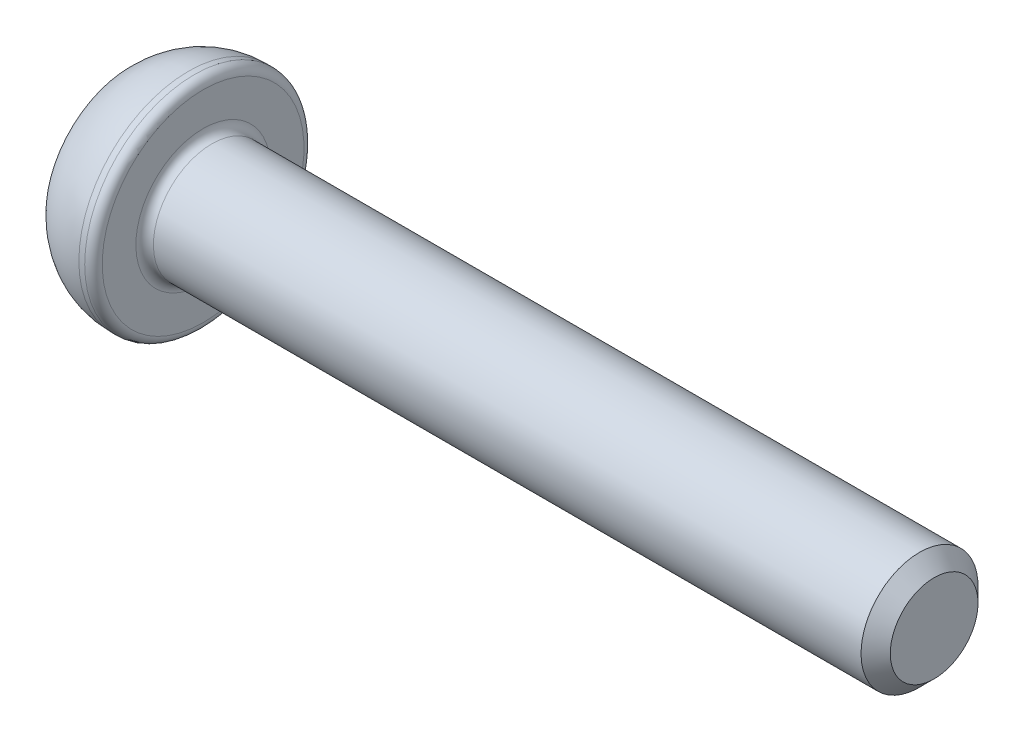
ISO-10303-21;
HEADER;
FILE_DESCRIPTION(('STEP AP214'),'2;1');
FILE_NAME('part.step','',(''),(''),'','','');
FILE_SCHEMA(('AUTOMOTIVE_DESIGN { 1 0 10303 214 1 1 1 1 }'));
ENDSEC;
DATA;
#1=APPLICATION_CONTEXT('core data for automotive mechanical design processes');
#2=APPLICATION_PROTOCOL_DEFINITION('international standard','automotive_design',2000,#1);
#3=PRODUCT_CONTEXT('',#1,'mechanical');
#4=PRODUCT('Part','Part','',(#3));
#5=PRODUCT_RELATED_PRODUCT_CATEGORY('part','',(#4));
#6=PRODUCT_DEFINITION_FORMATION('','',#4);
#7=PRODUCT_DEFINITION_CONTEXT('part definition',#1,'design');
#8=PRODUCT_DEFINITION('design','',#6,#7);
#9=PRODUCT_DEFINITION_SHAPE('','',#8);
#10=(LENGTH_UNIT() NAMED_UNIT(*) SI_UNIT(.MILLI.,.METRE.));
#11=(NAMED_UNIT(*) PLANE_ANGLE_UNIT() SI_UNIT($,.RADIAN.));
#12=(NAMED_UNIT(*) SI_UNIT($,.STERADIAN.) SOLID_ANGLE_UNIT());
#13=UNCERTAINTY_MEASURE_WITH_UNIT(LENGTH_MEASURE(1.E-05),#10,'distance_accuracy_value','');
#14=(GEOMETRIC_REPRESENTATION_CONTEXT(3) GLOBAL_UNCERTAINTY_ASSIGNED_CONTEXT((#13)) GLOBAL_UNIT_ASSIGNED_CONTEXT((#10,
#11,#12)) REPRESENTATION_CONTEXT('',''));
#15=CARTESIAN_POINT('',(0.,0.,0.));
#16=DIRECTION('',(0.,0.,1.));
#17=DIRECTION('',(1.,0.,0.));
#18=AXIS2_PLACEMENT_3D('',#15,#16,#17);
#19=CARTESIAN_POINT('',(0.,0.,0.));
#20=DIRECTION('',(-1.,0.,0.));
#21=DIRECTION('',(0.,-1.,0.));
#22=AXIS2_PLACEMENT_3D('',#19,#20,#21);
#23=PLANE('',#22);
#24=DIRECTION('',(0.,0.866025403784438,-0.5));
#25=VECTOR('',#24,1.);
#26=CARTESIAN_POINT('',(0.,0.,1.44337567297407));
#27=LINE('',#26,#25);
#28=CARTESIAN_POINT('',(0.,0.,1.44337567297407));
#29=VERTEX_POINT('',#28);
#30=CARTESIAN_POINT('',(0.,1.25,0.721687836487032));
#31=VERTEX_POINT('',#30);
#32=EDGE_CURVE('E55',#29,#31,#27,.T.);
#33=ORIENTED_EDGE('',*,*,#32,.F.);
#34=DIRECTION('',(0.,0.866025403784438,0.5));
#35=VECTOR('',#34,1.);
#36=CARTESIAN_POINT('',(0.,-1.25,0.721687836487033));
#37=LINE('',#36,#35);
#38=CARTESIAN_POINT('',(0.,-1.25,0.721687836487033));
#39=VERTEX_POINT('',#38);
#40=EDGE_CURVE('E138',#39,#29,#37,.T.);
#41=ORIENTED_EDGE('',*,*,#40,.F.);
#42=DIRECTION('',(0.,0.,1.));
#43=VECTOR('',#42,1.);
#44=CARTESIAN_POINT('',(0.,-1.25,-0.721687836487032));
#45=LINE('',#44,#43);
#46=CARTESIAN_POINT('',(0.,-1.25,-0.721687836487032));
#47=VERTEX_POINT('',#46);
#48=EDGE_CURVE('E136',#47,#39,#45,.T.);
#49=ORIENTED_EDGE('',*,*,#48,.F.);
#50=DIRECTION('',(0.,-0.866025403784438,0.5));
#51=VECTOR('',#50,1.);
#52=CARTESIAN_POINT('',(0.,0.,-1.44337567297407));
#53=LINE('',#52,#51);
#54=CARTESIAN_POINT('',(0.,0.,-1.44337567297407));
#55=VERTEX_POINT('',#54);
#56=EDGE_CURVE('E103',#55,#47,#53,.T.);
#57=ORIENTED_EDGE('',*,*,#56,.F.);
#58=DIRECTION('',(0.,-0.866025403784438,-0.5));
#59=VECTOR('',#58,1.);
#60=CARTESIAN_POINT('',(0.,1.25,-0.721687836487032));
#61=LINE('',#60,#59);
#62=CARTESIAN_POINT('',(0.,1.25,-0.721687836487032));
#63=VERTEX_POINT('',#62);
#64=EDGE_CURVE('E132',#63,#55,#61,.T.);
#65=ORIENTED_EDGE('',*,*,#64,.F.);
#66=DIRECTION('',(0.,0.,-1.));
#67=VECTOR('',#66,1.);
#68=CARTESIAN_POINT('',(0.,1.25,0.721687836487032));
#69=LINE('',#68,#67);
#70=EDGE_CURVE('E129',#31,#63,#69,.T.);
#71=ORIENTED_EDGE('',*,*,#70,.F.);
#72=EDGE_LOOP('',(#33,#41,#49,#57,#65,#71));
#73=FACE_BOUND('',#72,.T.);
#74=CARTESIAN_POINT('',(0.,0.,0.));
#75=DIRECTION('',(1.,0.,0.));
#76=DIRECTION('',(0.,1.,0.));
#77=AXIS2_PLACEMENT_3D('',#74,#75,#76);
#78=CIRCLE('',#77,2.875);
#79=CARTESIAN_POINT('',(0.,2.875,0.));
#80=VERTEX_POINT('',#79);
#81=EDGE_CURVE('E150',#80,#80,#78,.T.);
#82=ORIENTED_EDGE('',*,*,#81,.F.);
#83=EDGE_LOOP('',(#82));
#84=FACE_BOUND('',#83,.T.);
#85=ADVANCED_FACE('F39',(#73,#84),#23,.T.);
#86=CARTESIAN_POINT('',(2.,0.,0.));
#87=DIRECTION('',(1.,0.,0.));
#88=DIRECTION('',(0.,1.,0.));
#89=AXIS2_PLACEMENT_3D('',#86,#87,#88);
#90=DEGENERATE_TOROIDAL_SURFACE('',#89,1.02678571428571,2.72321428571429,.T.);
#91=ORIENTED_EDGE('',*,*,#81,.T.);
#92=EDGE_LOOP('',(#91));
#93=FACE_BOUND('',#92,.T.);
#94=CARTESIAN_POINT('',(2.,0.,0.));
#95=DIRECTION('',(1.,0.,0.));
#96=DIRECTION('',(0.,1.,0.));
#97=AXIS2_PLACEMENT_3D('',#94,#95,#96);
#98=CIRCLE('',#97,3.75);
#99=CARTESIAN_POINT('',(2.,3.75,0.));
#100=VERTEX_POINT('',#99);
#101=EDGE_CURVE('E142',#100,#100,#98,.T.);
#102=ORIENTED_EDGE('',*,*,#101,.F.);
#103=EDGE_LOOP('',(#102));
#104=FACE_BOUND('',#103,.T.);
#105=ADVANCED_FACE('F179',(#93,#104),#90,.T.);
#106=CARTESIAN_POINT('',(27.5,0.,0.));
#107=DIRECTION('',(1.,0.,0.));
#108=DIRECTION('',(0.,1.,0.));
#109=AXIS2_PLACEMENT_3D('',#106,#107,#108);
#110=CYLINDRICAL_SURFACE('',#109,3.75);
#111=CARTESIAN_POINT('',(2.2,0.,0.));
#112=DIRECTION('',(1.,0.,0.));
#113=DIRECTION('',(0.,1.,0.));
#114=AXIS2_PLACEMENT_3D('',#111,#112,#113);
#115=CIRCLE('',#114,3.75);
#116=CARTESIAN_POINT('',(2.2,3.75,0.));
#117=VERTEX_POINT('',#116);
#118=EDGE_CURVE('E162',#117,#117,#115,.F.);
#119=ORIENTED_EDGE('',*,*,#118,.T.);
#120=EDGE_LOOP('',(#119));
#121=FACE_BOUND('',#120,.T.);
#122=ORIENTED_EDGE('',*,*,#101,.T.);
#123=EDGE_LOOP('',(#122));
#124=FACE_BOUND('',#123,.T.);
#125=ADVANCED_FACE('F185',(#121,#124),#110,.T.);
#126=CARTESIAN_POINT('',(2.5,3.75,0.));
#127=DIRECTION('',(1.,0.,0.));
#128=DIRECTION('',(0.,1.,0.));
#129=AXIS2_PLACEMENT_3D('',#126,#127,#128);
#130=PLANE('',#129);
#131=CARTESIAN_POINT('',(2.5,0.,0.));
#132=DIRECTION('',(1.,0.,0.));
#133=DIRECTION('',(0.,1.,0.));
#134=AXIS2_PLACEMENT_3D('',#131,#132,#133);
#135=CIRCLE('',#134,2.3);
#136=CARTESIAN_POINT('',(2.5,2.3,0.));
#137=VERTEX_POINT('',#136);
#138=EDGE_CURVE('E159',#137,#137,#135,.F.);
#139=ORIENTED_EDGE('',*,*,#138,.T.);
#140=EDGE_LOOP('',(#139));
#141=FACE_BOUND('',#140,.T.);
#142=CARTESIAN_POINT('',(2.5,0.,0.));
#143=DIRECTION('',(1.,0.,0.));
#144=DIRECTION('',(0.,1.,0.));
#145=AXIS2_PLACEMENT_3D('',#142,#143,#144);
#146=CIRCLE('',#145,3.45);
#147=CARTESIAN_POINT('',(2.5,3.45,0.));
#148=VERTEX_POINT('',#147);
#149=EDGE_CURVE('E156',#148,#148,#146,.T.);
#150=ORIENTED_EDGE('',*,*,#149,.T.);
#151=EDGE_LOOP('',(#150));
#152=FACE_BOUND('',#151,.T.);
#153=ADVANCED_FACE('F204',(#141,#152),#130,.T.);
#154=CARTESIAN_POINT('',(27.5,0.,0.));
#155=DIRECTION('',(1.,0.,0.));
#156=DIRECTION('',(0.,1.,0.));
#157=AXIS2_PLACEMENT_3D('',#154,#155,#156);
#158=CYLINDRICAL_SURFACE('',#157,2.);
#159=CARTESIAN_POINT('',(27.,0.,0.));
#160=DIRECTION('',(1.,0.,0.));
#161=DIRECTION('',(0.,1.,0.));
#162=AXIS2_PLACEMENT_3D('',#159,#160,#161);
#163=CIRCLE('',#162,2.);
#164=CARTESIAN_POINT('',(27.,2.,0.));
#165=VERTEX_POINT('',#164);
#166=EDGE_CURVE('E11',#165,#165,#163,.F.);
#167=ORIENTED_EDGE('',*,*,#166,.T.);
#168=EDGE_LOOP('',(#167));
#169=FACE_BOUND('',#168,.T.);
#170=CARTESIAN_POINT('',(2.8,0.,0.));
#171=DIRECTION('',(1.,0.,0.));
#172=DIRECTION('',(0.,1.,0.));
#173=AXIS2_PLACEMENT_3D('',#170,#171,#172);
#174=CIRCLE('',#173,2.);
#175=CARTESIAN_POINT('',(2.8,2.,0.));
#176=VERTEX_POINT('',#175);
#177=EDGE_CURVE('E153',#176,#176,#174,.T.);
#178=ORIENTED_EDGE('',*,*,#177,.T.);
#179=EDGE_LOOP('',(#178));
#180=FACE_BOUND('',#179,.T.);
#181=ADVANCED_FACE('F202',(#169,#180),#158,.T.);
#182=CARTESIAN_POINT('',(27.5,2.,0.));
#183=DIRECTION('',(1.,0.,0.));
#184=DIRECTION('',(0.,1.,0.));
#185=AXIS2_PLACEMENT_3D('',#182,#183,#184);
#186=PLANE('',#185);
#187=CARTESIAN_POINT('',(27.5,0.,0.));
#188=DIRECTION('',(1.,0.,0.));
#189=DIRECTION('',(0.,1.,0.));
#190=AXIS2_PLACEMENT_3D('',#187,#188,#189);
#191=CIRCLE('',#190,1.49999999999999);
#192=CARTESIAN_POINT('',(27.5,1.49999999999999,0.));
#193=VERTEX_POINT('',#192);
#194=EDGE_CURVE('E48',#193,#193,#191,.T.);
#195=ORIENTED_EDGE('',*,*,#194,.T.);
#196=EDGE_LOOP('',(#195));
#197=FACE_BOUND('',#196,.T.);
#198=ADVANCED_FACE('F167',(#197),#186,.T.);
#199=CARTESIAN_POINT('',(1.5,0.,1.44337567297407));
#200=DIRECTION('',(0.,0.5,0.866025403784438));
#201=DIRECTION('',(0.,-0.866025403784439,0.5));
#202=AXIS2_PLACEMENT_3D('',#199,#200,#201);
#203=PLANE('',#202);
#204=ORIENTED_EDGE('',*,*,#32,.T.);
#205=DIRECTION('',(-1.,0.,0.));
#206=VECTOR('',#205,1.);
#207=CARTESIAN_POINT('',(1.5,1.25,0.721687836487032));
#208=LINE('',#207,#206);
#209=CARTESIAN_POINT('',(1.5,1.25,0.721687836487032));
#210=VERTEX_POINT('',#209);
#211=EDGE_CURVE('E85',#210,#31,#208,.T.);
#212=ORIENTED_EDGE('',*,*,#211,.F.);
#213=DIRECTION('',(0.,0.866025403784438,-0.5));
#214=VECTOR('',#213,1.);
#215=CARTESIAN_POINT('',(1.5,0.,1.44337567297407));
#216=LINE('',#215,#214);
#217=CARTESIAN_POINT('',(1.5,0.,1.44337567297407));
#218=VERTEX_POINT('',#217);
#219=EDGE_CURVE('E140',#218,#210,#216,.T.);
#220=ORIENTED_EDGE('',*,*,#219,.F.);
#221=DIRECTION('',(-1.,0.,0.));
#222=VECTOR('',#221,1.);
#223=CARTESIAN_POINT('',(1.5,0.,1.44337567297407));
#224=LINE('',#223,#222);
#225=EDGE_CURVE('E63',#218,#29,#224,.T.);
#226=ORIENTED_EDGE('',*,*,#225,.T.);
#227=EDGE_LOOP('',(#204,#212,#220,#226));
#228=FACE_BOUND('',#227,.T.);
#229=ADVANCED_FACE('F211',(#228),#203,.F.);
#230=CARTESIAN_POINT('',(1.5,-1.25,0.721687836487033));
#231=DIRECTION('',(0.,-0.5,0.866025403784439));
#232=DIRECTION('',(0.,-0.866025403784439,-0.5));
#233=AXIS2_PLACEMENT_3D('',#230,#231,#232);
#234=PLANE('',#233);
#235=ORIENTED_EDGE('',*,*,#40,.T.);
#236=ORIENTED_EDGE('',*,*,#225,.F.);
#237=DIRECTION('',(0.,0.866025403784438,0.5));
#238=VECTOR('',#237,1.);
#239=CARTESIAN_POINT('',(1.5,-1.25,0.721687836487033));
#240=LINE('',#239,#238);
#241=CARTESIAN_POINT('',(1.5,-1.25,0.721687836487033));
#242=VERTEX_POINT('',#241);
#243=EDGE_CURVE('E115',#242,#218,#240,.T.);
#244=ORIENTED_EDGE('',*,*,#243,.F.);
#245=DIRECTION('',(-1.,0.,0.));
#246=VECTOR('',#245,1.);
#247=CARTESIAN_POINT('',(1.5,-1.25,0.721687836487033));
#248=LINE('',#247,#246);
#249=EDGE_CURVE('E107',#242,#39,#248,.T.);
#250=ORIENTED_EDGE('',*,*,#249,.T.);
#251=EDGE_LOOP('',(#235,#236,#244,#250));
#252=FACE_BOUND('',#251,.T.);
#253=ADVANCED_FACE('F270',(#252),#234,.F.);
#254=CARTESIAN_POINT('',(1.5,-1.25,-0.721687836487032));
#255=DIRECTION('',(0.,-1.,0.));
#256=DIRECTION('',(0.,0.,-1.));
#257=AXIS2_PLACEMENT_3D('',#254,#255,#256);
#258=PLANE('',#257);
#259=ORIENTED_EDGE('',*,*,#48,.T.);
#260=ORIENTED_EDGE('',*,*,#249,.F.);
#261=DIRECTION('',(0.,0.,1.));
#262=VECTOR('',#261,1.);
#263=CARTESIAN_POINT('',(1.5,-1.25,-0.721687836487032));
#264=LINE('',#263,#262);
#265=CARTESIAN_POINT('',(1.5,-1.25,-0.721687836487032));
#266=VERTEX_POINT('',#265);
#267=EDGE_CURVE('E111',#266,#242,#264,.T.);
#268=ORIENTED_EDGE('',*,*,#267,.F.);
#269=DIRECTION('',(-1.,0.,0.));
#270=VECTOR('',#269,1.);
#271=CARTESIAN_POINT('',(1.5,-1.25,-0.721687836487032));
#272=LINE('',#271,#270);
#273=EDGE_CURVE('E96',#266,#47,#272,.T.);
#274=ORIENTED_EDGE('',*,*,#273,.T.);
#275=EDGE_LOOP('',(#259,#260,#268,#274));
#276=FACE_BOUND('',#275,.T.);
#277=ADVANCED_FACE('F112',(#276),#258,.F.);
#278=CARTESIAN_POINT('',(1.5,0.,-1.44337567297407));
#279=DIRECTION('',(0.,-0.5,-0.866025403784439));
#280=DIRECTION('',(0.,0.866025403784439,-0.5));
#281=AXIS2_PLACEMENT_3D('',#278,#279,#280);
#282=PLANE('',#281);
#283=ORIENTED_EDGE('',*,*,#56,.T.);
#284=ORIENTED_EDGE('',*,*,#273,.F.);
#285=DIRECTION('',(0.,-0.866025403784438,0.5));
#286=VECTOR('',#285,1.);
#287=CARTESIAN_POINT('',(1.5,0.,-1.44337567297407));
#288=LINE('',#287,#286);
#289=CARTESIAN_POINT('',(1.5,0.,-1.44337567297407));
#290=VERTEX_POINT('',#289);
#291=EDGE_CURVE('E100',#290,#266,#288,.T.);
#292=ORIENTED_EDGE('',*,*,#291,.F.);
#293=DIRECTION('',(-1.,0.,0.));
#294=VECTOR('',#293,1.);
#295=CARTESIAN_POINT('',(1.5,0.,-1.44337567297407));
#296=LINE('',#295,#294);
#297=EDGE_CURVE('E108',#290,#55,#296,.T.);
#298=ORIENTED_EDGE('',*,*,#297,.T.);
#299=EDGE_LOOP('',(#283,#284,#292,#298));
#300=FACE_BOUND('',#299,.T.);
#301=ADVANCED_FACE('F98',(#300),#282,.F.);
#302=CARTESIAN_POINT('',(1.5,1.25,-0.721687836487032));
#303=DIRECTION('',(0.,0.5,-0.866025403784438));
#304=DIRECTION('',(0.,0.866025403784439,0.5));
#305=AXIS2_PLACEMENT_3D('',#302,#303,#304);
#306=PLANE('',#305);
#307=ORIENTED_EDGE('',*,*,#64,.T.);
#308=ORIENTED_EDGE('',*,*,#297,.F.);
#309=DIRECTION('',(0.,-0.866025403784438,-0.5));
#310=VECTOR('',#309,1.);
#311=CARTESIAN_POINT('',(1.5,1.25,-0.721687836487032));
#312=LINE('',#311,#310);
#313=CARTESIAN_POINT('',(1.5,1.25,-0.721687836487032));
#314=VERTEX_POINT('',#313);
#315=EDGE_CURVE('E121',#314,#290,#312,.T.);
#316=ORIENTED_EDGE('',*,*,#315,.F.);
#317=DIRECTION('',(-1.,0.,0.));
#318=VECTOR('',#317,1.);
#319=CARTESIAN_POINT('',(1.5,1.25,-0.721687836487032));
#320=LINE('',#319,#318);
#321=EDGE_CURVE('E145',#314,#63,#320,.T.);
#322=ORIENTED_EDGE('',*,*,#321,.T.);
#323=EDGE_LOOP('',(#307,#308,#316,#322));
#324=FACE_BOUND('',#323,.T.);
#325=ADVANCED_FACE('F287',(#324),#306,.F.);
#326=CARTESIAN_POINT('',(1.5,1.25,0.721687836487032));
#327=DIRECTION('',(0.,1.,0.));
#328=DIRECTION('',(0.,0.,1.));
#329=AXIS2_PLACEMENT_3D('',#326,#327,#328);
#330=PLANE('',#329);
#331=ORIENTED_EDGE('',*,*,#70,.T.);
#332=ORIENTED_EDGE('',*,*,#321,.F.);
#333=DIRECTION('',(0.,0.,-1.));
#334=VECTOR('',#333,1.);
#335=CARTESIAN_POINT('',(1.5,1.25,0.721687836487032));
#336=LINE('',#335,#334);
#337=EDGE_CURVE('E123',#210,#314,#336,.T.);
#338=ORIENTED_EDGE('',*,*,#337,.F.);
#339=ORIENTED_EDGE('',*,*,#211,.T.);
#340=EDGE_LOOP('',(#331,#332,#338,#339));
#341=FACE_BOUND('',#340,.T.);
#342=ADVANCED_FACE('F196',(#341),#330,.F.);
#343=CARTESIAN_POINT('',(1.5,0.,0.));
#344=DIRECTION('',(-1.,0.,0.));
#345=DIRECTION('',(0.,0.,1.));
#346=AXIS2_PLACEMENT_3D('',#343,#344,#345);
#347=PLANE('',#346);
#348=ORIENTED_EDGE('',*,*,#219,.T.);
#349=ORIENTED_EDGE('',*,*,#337,.T.);
#350=ORIENTED_EDGE('',*,*,#315,.T.);
#351=ORIENTED_EDGE('',*,*,#291,.T.);
#352=ORIENTED_EDGE('',*,*,#267,.T.);
#353=ORIENTED_EDGE('',*,*,#243,.T.);
#354=EDGE_LOOP('',(#348,#349,#350,#351,#352,#353));
#355=FACE_BOUND('',#354,.T.);
#356=ADVANCED_FACE('F118',(#355),#347,.T.);
#357=CARTESIAN_POINT('',(2.8,0.,0.));
#358=DIRECTION('',(1.,0.,0.));
#359=DIRECTION('',(0.,1.,0.));
#360=AXIS2_PLACEMENT_3D('',#357,#358,#359);
#361=TOROIDAL_SURFACE('',#360,2.3,0.3);
#362=ORIENTED_EDGE('',*,*,#138,.F.);
#363=EDGE_LOOP('',(#362));
#364=FACE_BOUND('',#363,.T.);
#365=ORIENTED_EDGE('',*,*,#177,.F.);
#366=EDGE_LOOP('',(#365));
#367=FACE_BOUND('',#366,.T.);
#368=ADVANCED_FACE('F175',(#364,#367),#361,.F.);
#369=CARTESIAN_POINT('',(2.2,0.,0.));
#370=DIRECTION('',(1.,0.,0.));
#371=DIRECTION('',(0.,1.,0.));
#372=AXIS2_PLACEMENT_3D('',#369,#370,#371);
#373=TOROIDAL_SURFACE('',#372,3.45,0.3);
#374=ORIENTED_EDGE('',*,*,#118,.F.);
#375=EDGE_LOOP('',(#374));
#376=FACE_BOUND('',#375,.T.);
#377=ORIENTED_EDGE('',*,*,#149,.F.);
#378=EDGE_LOOP('',(#377));
#379=FACE_BOUND('',#378,.T.);
#380=ADVANCED_FACE('F170',(#376,#379),#373,.T.);
#381=CARTESIAN_POINT('',(27.5,0.,0.));
#382=DIRECTION('',(-1.,0.,0.));
#383=DIRECTION('',(0.,-1.,0.));
#384=AXIS2_PLACEMENT_3D('',#381,#382,#383);
#385=CONICAL_SURFACE('',#384,1.49999999999999,0.78539816339745);
#386=ORIENTED_EDGE('',*,*,#166,.F.);
#387=EDGE_LOOP('',(#386));
#388=FACE_BOUND('',#387,.T.);
#389=ORIENTED_EDGE('',*,*,#194,.F.);
#390=EDGE_LOOP('',(#389));
#391=FACE_BOUND('',#390,.T.);
#392=ADVANCED_FACE('F42',(#388,#391),#385,.T.);
#393=CLOSED_SHELL('',(#85,#105,#125,#153,#181,#198,#229,#253,#277,#301,#325,#342,#356,#368,#380,#392));
#394=MANIFOLD_SOLID_BREP('B2',#393);
#395=ADVANCED_BREP_SHAPE_REPRESENTATION('',(#18,#394),#14);
#396=SHAPE_DEFINITION_REPRESENTATION(#9,#395);
ENDSEC;
END-ISO-10303-21;
